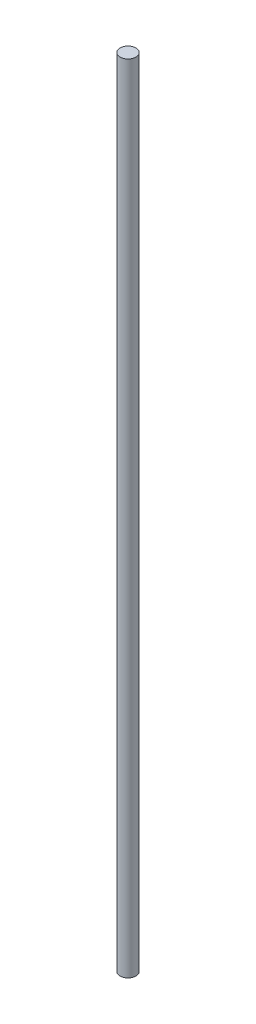
ISO-10303-21;
HEADER;
FILE_DESCRIPTION(('STEP AP214'),'2;1');
FILE_NAME('part.step','',(''),(''),'','','');
FILE_SCHEMA(('AUTOMOTIVE_DESIGN { 1 0 10303 214 1 1 1 1 }'));
ENDSEC;
DATA;
#1=APPLICATION_CONTEXT('core data for automotive mechanical design processes');
#2=APPLICATION_PROTOCOL_DEFINITION('international standard','automotive_design',2000,#1);
#3=PRODUCT_CONTEXT('',#1,'mechanical');
#4=PRODUCT('Part','Part','',(#3));
#5=PRODUCT_RELATED_PRODUCT_CATEGORY('part','',(#4));
#6=PRODUCT_DEFINITION_FORMATION('','',#4);
#7=PRODUCT_DEFINITION_CONTEXT('part definition',#1,'design');
#8=PRODUCT_DEFINITION('design','',#6,#7);
#9=PRODUCT_DEFINITION_SHAPE('','',#8);
#10=(LENGTH_UNIT() NAMED_UNIT(*) SI_UNIT(.MILLI.,.METRE.));
#11=(NAMED_UNIT(*) PLANE_ANGLE_UNIT() SI_UNIT($,.RADIAN.));
#12=(NAMED_UNIT(*) SI_UNIT($,.STERADIAN.) SOLID_ANGLE_UNIT());
#13=UNCERTAINTY_MEASURE_WITH_UNIT(LENGTH_MEASURE(1.E-05),#10,'distance_accuracy_value','');
#14=(GEOMETRIC_REPRESENTATION_CONTEXT(3) GLOBAL_UNCERTAINTY_ASSIGNED_CONTEXT((#13)) GLOBAL_UNIT_ASSIGNED_CONTEXT((#10,
#11,#12)) REPRESENTATION_CONTEXT('',''));
#15=CARTESIAN_POINT('',(0.,0.,0.));
#16=DIRECTION('',(0.,0.,1.));
#17=DIRECTION('',(1.,0.,0.));
#18=AXIS2_PLACEMENT_3D('',#15,#16,#17);
#19=CARTESIAN_POINT('',(0.,400.,0.));
#20=DIRECTION('',(0.,-1.,0.));
#21=DIRECTION('',(0.,0.,-1.));
#22=AXIS2_PLACEMENT_3D('',#19,#20,#21);
#23=CYLINDRICAL_SURFACE('',#22,4.);
#24=CARTESIAN_POINT('',(0.,400.,0.));
#25=DIRECTION('',(0.,1.,0.));
#26=DIRECTION('',(0.,0.,1.));
#27=AXIS2_PLACEMENT_3D('',#24,#25,#26);
#28=CIRCLE('',#27,4.);
#29=CARTESIAN_POINT('',(0.,400.,4.));
#30=VERTEX_POINT('',#29);
#31=EDGE_CURVE('E10',#30,#30,#28,.T.);
#32=ORIENTED_EDGE('',*,*,#31,.F.);
#33=EDGE_LOOP('',(#32));
#34=FACE_BOUND('',#33,.T.);
#35=CARTESIAN_POINT('',(0.,0.,0.));
#36=DIRECTION('',(0.,1.,0.));
#37=DIRECTION('',(0.,0.,1.));
#38=AXIS2_PLACEMENT_3D('',#35,#36,#37);
#39=CIRCLE('',#38,4.);
#40=CARTESIAN_POINT('',(0.,0.,4.));
#41=VERTEX_POINT('',#40);
#42=EDGE_CURVE('E32',#41,#41,#39,.T.);
#43=ORIENTED_EDGE('',*,*,#42,.T.);
#44=EDGE_LOOP('',(#43));
#45=FACE_BOUND('',#44,.T.);
#46=ADVANCED_FACE('F29',(#34,#45),#23,.T.);
#47=CARTESIAN_POINT('',(0.,400.,0.));
#48=DIRECTION('',(0.,1.,0.));
#49=DIRECTION('',(0.,0.,1.));
#50=AXIS2_PLACEMENT_3D('',#47,#48,#49);
#51=PLANE('',#50);
#52=ORIENTED_EDGE('',*,*,#31,.T.);
#53=EDGE_LOOP('',(#52));
#54=FACE_BOUND('',#53,.T.);
#55=ADVANCED_FACE('F44',(#54),#51,.T.);
#56=CARTESIAN_POINT('',(0.,0.,0.));
#57=DIRECTION('',(0.,1.,0.));
#58=DIRECTION('',(0.,0.,1.));
#59=AXIS2_PLACEMENT_3D('',#56,#57,#58);
#60=PLANE('',#59);
#61=ORIENTED_EDGE('',*,*,#42,.F.);
#62=EDGE_LOOP('',(#61));
#63=FACE_BOUND('',#62,.T.);
#64=ADVANCED_FACE('F42',(#63),#60,.F.);
#65=CLOSED_SHELL('',(#46,#55,#64));
#66=MANIFOLD_SOLID_BREP('B2',#65);
#67=ADVANCED_BREP_SHAPE_REPRESENTATION('',(#18,#66),#14);
#68=SHAPE_DEFINITION_REPRESENTATION(#9,#67);
ENDSEC;
END-ISO-10303-21;
